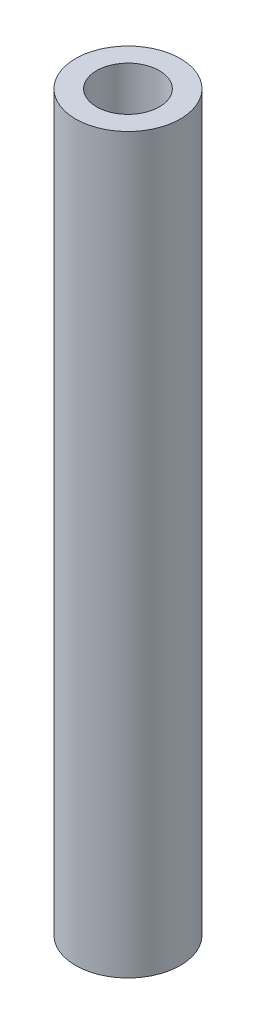
ISO-10303-21;
HEADER;
FILE_DESCRIPTION(('STEP AP214'),'2;1');
FILE_NAME('part.step','',(''),(''),'','','');
FILE_SCHEMA(('AUTOMOTIVE_DESIGN { 1 0 10303 214 1 1 1 1 }'));
ENDSEC;
DATA;
#1=APPLICATION_CONTEXT('core data for automotive mechanical design processes');
#2=APPLICATION_PROTOCOL_DEFINITION('international standard','automotive_design',2000,#1);
#3=PRODUCT_CONTEXT('',#1,'mechanical');
#4=PRODUCT('Part','Part','',(#3));
#5=PRODUCT_RELATED_PRODUCT_CATEGORY('part','',(#4));
#6=PRODUCT_DEFINITION_FORMATION('','',#4);
#7=PRODUCT_DEFINITION_CONTEXT('part definition',#1,'design');
#8=PRODUCT_DEFINITION('design','',#6,#7);
#9=PRODUCT_DEFINITION_SHAPE('','',#8);
#10=(LENGTH_UNIT() NAMED_UNIT(*) SI_UNIT(.MILLI.,.METRE.));
#11=(NAMED_UNIT(*) PLANE_ANGLE_UNIT() SI_UNIT($,.RADIAN.));
#12=(NAMED_UNIT(*) SI_UNIT($,.STERADIAN.) SOLID_ANGLE_UNIT());
#13=UNCERTAINTY_MEASURE_WITH_UNIT(LENGTH_MEASURE(1.E-05),#10,'distance_accuracy_value','');
#14=(GEOMETRIC_REPRESENTATION_CONTEXT(3) GLOBAL_UNCERTAINTY_ASSIGNED_CONTEXT((#13)) GLOBAL_UNIT_ASSIGNED_CONTEXT((#10,
#11,#12)) REPRESENTATION_CONTEXT('',''));
#15=CARTESIAN_POINT('',(0.,0.,0.));
#16=DIRECTION('',(0.,0.,1.));
#17=DIRECTION('',(1.,0.,0.));
#18=AXIS2_PLACEMENT_3D('',#15,#16,#17);
#19=CARTESIAN_POINT('',(0.,35.,0.));
#20=DIRECTION('',(0.,1.,0.));
#21=DIRECTION('',(0.,0.,1.));
#22=AXIS2_PLACEMENT_3D('',#19,#20,#21);
#23=PLANE('',#22);
#24=CARTESIAN_POINT('',(0.,35.,0.));
#25=DIRECTION('',(0.,1.,0.));
#26=DIRECTION('',(0.,0.,1.));
#27=AXIS2_PLACEMENT_3D('',#24,#25,#26);
#28=CIRCLE('',#27,2.5);
#29=CARTESIAN_POINT('',(0.,35.,2.5));
#30=VERTEX_POINT('',#29);
#31=EDGE_CURVE('E10',#30,#30,#28,.T.);
#32=ORIENTED_EDGE('',*,*,#31,.T.);
#33=EDGE_LOOP('',(#32));
#34=FACE_BOUND('',#33,.T.);
#35=CARTESIAN_POINT('',(0.,35.,0.));
#36=DIRECTION('',(0.,1.,0.));
#37=DIRECTION('',(0.,0.,1.));
#38=AXIS2_PLACEMENT_3D('',#35,#36,#37);
#39=CIRCLE('',#38,1.5);
#40=CARTESIAN_POINT('',(0.,35.,1.5));
#41=VERTEX_POINT('',#40);
#42=EDGE_CURVE('E43',#41,#41,#39,.T.);
#43=ORIENTED_EDGE('',*,*,#42,.F.);
#44=EDGE_LOOP('',(#43));
#45=FACE_BOUND('',#44,.T.);
#46=ADVANCED_FACE('F32',(#34,#45),#23,.T.);
#47=CARTESIAN_POINT('',(0.,0.,0.));
#48=DIRECTION('',(0.,1.,0.));
#49=DIRECTION('',(0.,0.,1.));
#50=AXIS2_PLACEMENT_3D('',#47,#48,#49);
#51=PLANE('',#50);
#52=CARTESIAN_POINT('',(0.,0.,0.));
#53=DIRECTION('',(0.,1.,0.));
#54=DIRECTION('',(0.,0.,1.));
#55=AXIS2_PLACEMENT_3D('',#52,#53,#54);
#56=CIRCLE('',#55,2.5);
#57=CARTESIAN_POINT('',(0.,0.,2.5));
#58=VERTEX_POINT('',#57);
#59=EDGE_CURVE('E36',#58,#58,#56,.T.);
#60=ORIENTED_EDGE('',*,*,#59,.F.);
#61=EDGE_LOOP('',(#60));
#62=FACE_BOUND('',#61,.T.);
#63=CARTESIAN_POINT('',(0.,0.,0.));
#64=DIRECTION('',(0.,1.,0.));
#65=DIRECTION('',(0.,0.,1.));
#66=AXIS2_PLACEMENT_3D('',#63,#64,#65);
#67=CIRCLE('',#66,1.5);
#68=CARTESIAN_POINT('',(0.,0.,1.5));
#69=VERTEX_POINT('',#68);
#70=EDGE_CURVE('E45',#69,#69,#67,.T.);
#71=ORIENTED_EDGE('',*,*,#70,.T.);
#72=EDGE_LOOP('',(#71));
#73=FACE_BOUND('',#72,.T.);
#74=ADVANCED_FACE('F55',(#62,#73),#51,.F.);
#75=CARTESIAN_POINT('',(0.,35.,0.));
#76=DIRECTION('',(0.,-1.,0.));
#77=DIRECTION('',(0.,0.,-1.));
#78=AXIS2_PLACEMENT_3D('',#75,#76,#77);
#79=CYLINDRICAL_SURFACE('',#78,2.5);
#80=ORIENTED_EDGE('',*,*,#31,.F.);
#81=EDGE_LOOP('',(#80));
#82=FACE_BOUND('',#81,.T.);
#83=ORIENTED_EDGE('',*,*,#59,.T.);
#84=EDGE_LOOP('',(#83));
#85=FACE_BOUND('',#84,.T.);
#86=ADVANCED_FACE('F34',(#82,#85),#79,.T.);
#87=CARTESIAN_POINT('',(0.,35.,0.));
#88=DIRECTION('',(0.,-1.,0.));
#89=DIRECTION('',(0.,0.,-1.));
#90=AXIS2_PLACEMENT_3D('',#87,#88,#89);
#91=CYLINDRICAL_SURFACE('',#90,1.5);
#92=ORIENTED_EDGE('',*,*,#42,.T.);
#93=EDGE_LOOP('',(#92));
#94=FACE_BOUND('',#93,.T.);
#95=ORIENTED_EDGE('',*,*,#70,.F.);
#96=EDGE_LOOP('',(#95));
#97=FACE_BOUND('',#96,.T.);
#98=ADVANCED_FACE('F51',(#94,#97),#91,.F.);
#99=CLOSED_SHELL('',(#46,#74,#86,#98));
#100=MANIFOLD_SOLID_BREP('B2',#99);
#101=ADVANCED_BREP_SHAPE_REPRESENTATION('',(#18,#100),#14);
#102=SHAPE_DEFINITION_REPRESENTATION(#9,#101);
ENDSEC;
END-ISO-10303-21;
